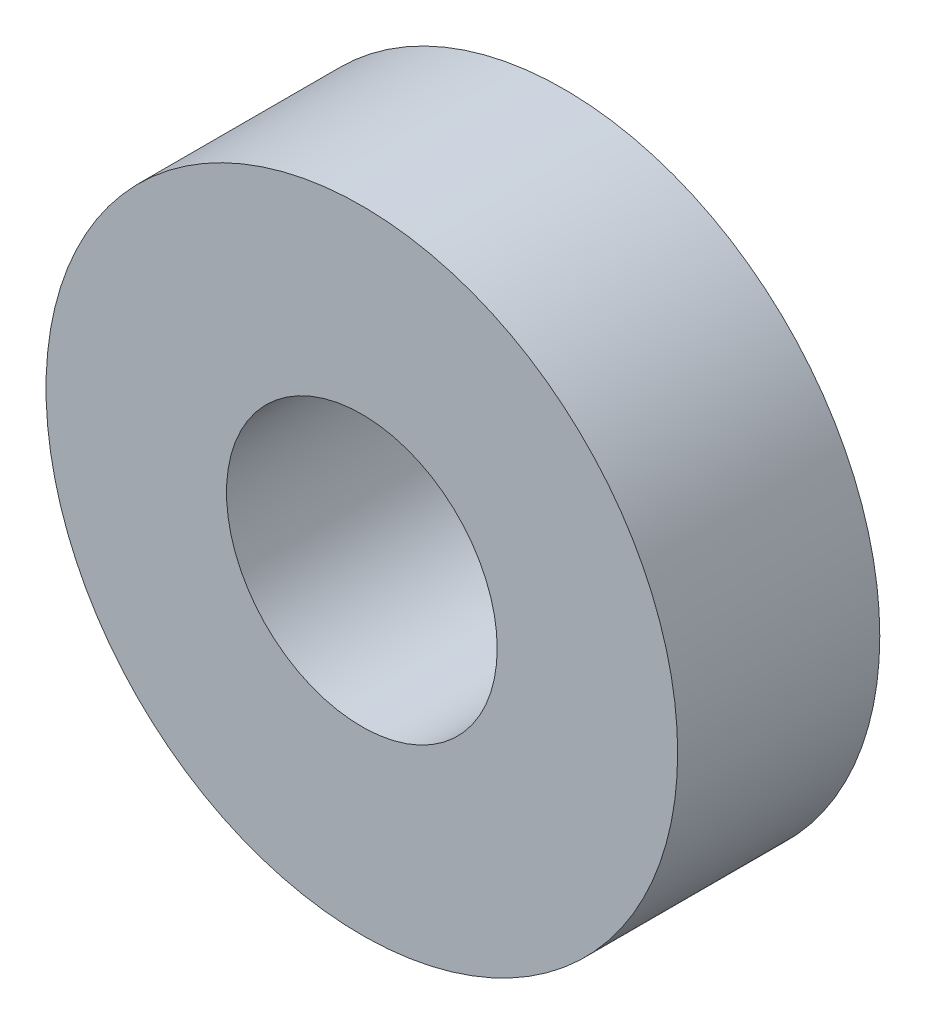
ISO-10303-21;
HEADER;
FILE_DESCRIPTION(('STEP AP214'),'2;1');
FILE_NAME('part.step','',(''),(''),'','','');
FILE_SCHEMA(('AUTOMOTIVE_DESIGN { 1 0 10303 214 1 1 1 1 }'));
ENDSEC;
DATA;
#1=APPLICATION_CONTEXT('core data for automotive mechanical design processes');
#2=APPLICATION_PROTOCOL_DEFINITION('international standard','automotive_design',2000,#1);
#3=PRODUCT_CONTEXT('',#1,'mechanical');
#4=PRODUCT('Part','Part','',(#3));
#5=PRODUCT_RELATED_PRODUCT_CATEGORY('part','',(#4));
#6=PRODUCT_DEFINITION_FORMATION('','',#4);
#7=PRODUCT_DEFINITION_CONTEXT('part definition',#1,'design');
#8=PRODUCT_DEFINITION('design','',#6,#7);
#9=PRODUCT_DEFINITION_SHAPE('','',#8);
#10=(LENGTH_UNIT() NAMED_UNIT(*) SI_UNIT(.MILLI.,.METRE.));
#11=(NAMED_UNIT(*) PLANE_ANGLE_UNIT() SI_UNIT($,.RADIAN.));
#12=(NAMED_UNIT(*) SI_UNIT($,.STERADIAN.) SOLID_ANGLE_UNIT());
#13=UNCERTAINTY_MEASURE_WITH_UNIT(LENGTH_MEASURE(1.E-05),#10,'distance_accuracy_value','');
#14=(GEOMETRIC_REPRESENTATION_CONTEXT(3) GLOBAL_UNCERTAINTY_ASSIGNED_CONTEXT((#13)) GLOBAL_UNIT_ASSIGNED_CONTEXT((#10,
#11,#12)) REPRESENTATION_CONTEXT('',''));
#15=CARTESIAN_POINT('',(0.,0.,0.));
#16=DIRECTION('',(0.,0.,1.));
#17=DIRECTION('',(1.,0.,0.));
#18=AXIS2_PLACEMENT_3D('',#15,#16,#17);
#19=CARTESIAN_POINT('',(0.,0.,7.112));
#20=DIRECTION('',(0.,0.,1.));
#21=DIRECTION('',(1.,0.,0.));
#22=AXIS2_PLACEMENT_3D('',#19,#20,#21);
#23=PLANE('',#22);
#24=CARTESIAN_POINT('',(0.,0.,7.112));
#25=DIRECTION('',(0.,0.,1.));
#26=DIRECTION('',(1.,0.,0.));
#27=AXIS2_PLACEMENT_3D('',#24,#25,#26);
#28=CIRCLE('',#27,11.1125);
#29=CARTESIAN_POINT('',(11.1125,0.,7.112));
#30=VERTEX_POINT('',#29);
#31=EDGE_CURVE('E10',#30,#30,#28,.T.);
#32=ORIENTED_EDGE('',*,*,#31,.T.);
#33=EDGE_LOOP('',(#32));
#34=FACE_BOUND('',#33,.T.);
#35=CARTESIAN_POINT('',(0.,0.,7.112));
#36=DIRECTION('',(0.,0.,1.));
#37=DIRECTION('',(1.,0.,0.));
#38=AXIS2_PLACEMENT_3D('',#35,#36,#37);
#39=CIRCLE('',#38,4.7625);
#40=CARTESIAN_POINT('',(4.7625,0.,7.112));
#41=VERTEX_POINT('',#40);
#42=EDGE_CURVE('E41',#41,#41,#39,.T.);
#43=ORIENTED_EDGE('',*,*,#42,.F.);
#44=EDGE_LOOP('',(#43));
#45=FACE_BOUND('',#44,.T.);
#46=ADVANCED_FACE('F30',(#34,#45),#23,.T.);
#47=CARTESIAN_POINT('',(0.,0.,0.));
#48=DIRECTION('',(0.,0.,1.));
#49=DIRECTION('',(1.,0.,0.));
#50=AXIS2_PLACEMENT_3D('',#47,#48,#49);
#51=PLANE('',#50);
#52=CARTESIAN_POINT('',(0.,0.,0.));
#53=DIRECTION('',(0.,0.,1.));
#54=DIRECTION('',(1.,0.,0.));
#55=AXIS2_PLACEMENT_3D('',#52,#53,#54);
#56=CIRCLE('',#55,11.1125);
#57=CARTESIAN_POINT('',(11.1125,0.,0.));
#58=VERTEX_POINT('',#57);
#59=EDGE_CURVE('E34',#58,#58,#56,.T.);
#60=ORIENTED_EDGE('',*,*,#59,.F.);
#61=EDGE_LOOP('',(#60));
#62=FACE_BOUND('',#61,.T.);
#63=CARTESIAN_POINT('',(0.,0.,0.));
#64=DIRECTION('',(0.,0.,1.));
#65=DIRECTION('',(1.,0.,0.));
#66=AXIS2_PLACEMENT_3D('',#63,#64,#65);
#67=CIRCLE('',#66,4.7625);
#68=CARTESIAN_POINT('',(4.7625,0.,0.));
#69=VERTEX_POINT('',#68);
#70=EDGE_CURVE('E43',#69,#69,#67,.T.);
#71=ORIENTED_EDGE('',*,*,#70,.T.);
#72=EDGE_LOOP('',(#71));
#73=FACE_BOUND('',#72,.T.);
#74=ADVANCED_FACE('F53',(#62,#73),#51,.F.);
#75=CARTESIAN_POINT('',(0.,0.,7.112));
#76=DIRECTION('',(0.,0.,-1.));
#77=DIRECTION('',(-1.,0.,0.));
#78=AXIS2_PLACEMENT_3D('',#75,#76,#77);
#79=CYLINDRICAL_SURFACE('',#78,11.1125);
#80=ORIENTED_EDGE('',*,*,#31,.F.);
#81=EDGE_LOOP('',(#80));
#82=FACE_BOUND('',#81,.T.);
#83=ORIENTED_EDGE('',*,*,#59,.T.);
#84=EDGE_LOOP('',(#83));
#85=FACE_BOUND('',#84,.T.);
#86=ADVANCED_FACE('F32',(#82,#85),#79,.T.);
#87=CARTESIAN_POINT('',(0.,0.,7.112));
#88=DIRECTION('',(0.,0.,-1.));
#89=DIRECTION('',(-1.,0.,0.));
#90=AXIS2_PLACEMENT_3D('',#87,#88,#89);
#91=CYLINDRICAL_SURFACE('',#90,4.7625);
#92=ORIENTED_EDGE('',*,*,#42,.T.);
#93=EDGE_LOOP('',(#92));
#94=FACE_BOUND('',#93,.T.);
#95=ORIENTED_EDGE('',*,*,#70,.F.);
#96=EDGE_LOOP('',(#95));
#97=FACE_BOUND('',#96,.T.);
#98=ADVANCED_FACE('F49',(#94,#97),#91,.F.);
#99=CLOSED_SHELL('',(#46,#74,#86,#98));
#100=MANIFOLD_SOLID_BREP('B2',#99);
#101=ADVANCED_BREP_SHAPE_REPRESENTATION('',(#18,#100),#14);
#102=SHAPE_DEFINITION_REPRESENTATION(#9,#101);
ENDSEC;
END-ISO-10303-21;
